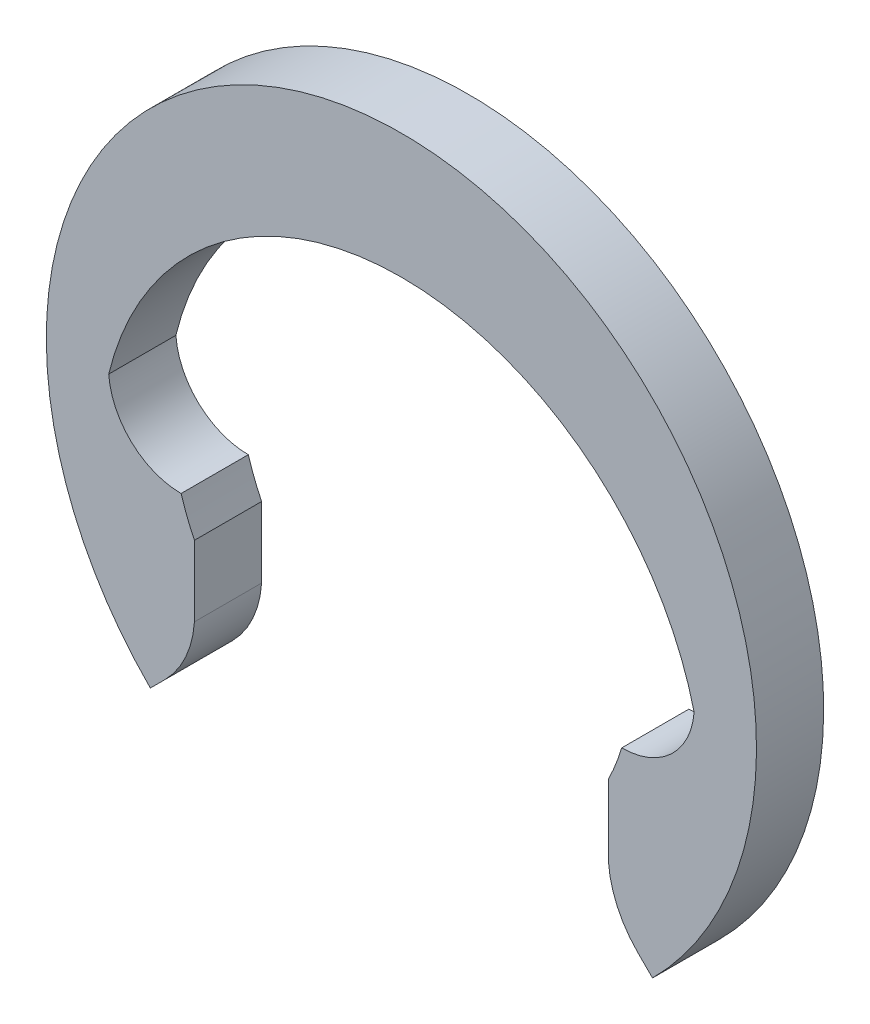
ISO-10303-21;
HEADER;
FILE_DESCRIPTION(('STEP AP214'),'2;1');
FILE_NAME('part.step','',(''),(''),'','','');
FILE_SCHEMA(('AUTOMOTIVE_DESIGN { 1 0 10303 214 1 1 1 1 }'));
ENDSEC;
DATA;
#1=APPLICATION_CONTEXT('core data for automotive mechanical design processes');
#2=APPLICATION_PROTOCOL_DEFINITION('international standard','automotive_design',2000,#1);
#3=PRODUCT_CONTEXT('',#1,'mechanical');
#4=PRODUCT('Part','Part','',(#3));
#5=PRODUCT_RELATED_PRODUCT_CATEGORY('part','',(#4));
#6=PRODUCT_DEFINITION_FORMATION('','',#4);
#7=PRODUCT_DEFINITION_CONTEXT('part definition',#1,'design');
#8=PRODUCT_DEFINITION('design','',#6,#7);
#9=PRODUCT_DEFINITION_SHAPE('','',#8);
#10=(LENGTH_UNIT() NAMED_UNIT(*) SI_UNIT(.MILLI.,.METRE.));
#11=(NAMED_UNIT(*) PLANE_ANGLE_UNIT() SI_UNIT($,.RADIAN.));
#12=(NAMED_UNIT(*) SI_UNIT($,.STERADIAN.) SOLID_ANGLE_UNIT());
#13=UNCERTAINTY_MEASURE_WITH_UNIT(LENGTH_MEASURE(1.E-05),#10,'distance_accuracy_value','');
#14=(GEOMETRIC_REPRESENTATION_CONTEXT(3) GLOBAL_UNCERTAINTY_ASSIGNED_CONTEXT((#13)) GLOBAL_UNIT_ASSIGNED_CONTEXT((#10,
#11,#12)) REPRESENTATION_CONTEXT('',''));
#15=CARTESIAN_POINT('',(0.,0.,0.));
#16=DIRECTION('',(0.,0.,1.));
#17=DIRECTION('',(1.,0.,0.));
#18=AXIS2_PLACEMENT_3D('',#15,#16,#17);
#19=CARTESIAN_POINT('',(-2.2956480566498,0.0564620388830174,0.7));
#20=DIRECTION('',(0.,0.,-1.));
#21=DIRECTION('',(-1.,0.,0.));
#22=AXIS2_PLACEMENT_3D('',#19,#20,#21);
#23=CYLINDRICAL_SURFACE('',#22,0.756462038883018);
#24=CARTESIAN_POINT('',(-2.2956480566498,0.0564620388830174,0.));
#25=DIRECTION('',(0.,0.,-1.));
#26=DIRECTION('',(1.,0.,0.));
#27=AXIS2_PLACEMENT_3D('',#24,#25,#26);
#28=CIRCLE('',#27,0.756462038883018);
#29=CARTESIAN_POINT('',(-2.2956480566498,-0.699999999999999,0.));
#30=VERTEX_POINT('',#29);
#31=CARTESIAN_POINT('',(-3.05,0.,0.));
#32=VERTEX_POINT('',#31);
#33=EDGE_CURVE('E152',#30,#32,#28,.T.);
#34=ORIENTED_EDGE('',*,*,#33,.T.);
#35=DIRECTION('',(0.,0.,-1.));
#36=VECTOR('',#35,1.);
#37=CARTESIAN_POINT('',(-3.05,0.,0.7));
#38=LINE('',#37,#36);
#39=CARTESIAN_POINT('',(-3.05,0.,0.7));
#40=VERTEX_POINT('',#39);
#41=EDGE_CURVE('E11',#40,#32,#38,.T.);
#42=ORIENTED_EDGE('',*,*,#41,.F.);
#43=CARTESIAN_POINT('',(-2.2956480566498,0.0564620388830174,0.7));
#44=DIRECTION('',(0.,0.,-1.));
#45=DIRECTION('',(1.,0.,0.));
#46=AXIS2_PLACEMENT_3D('',#43,#44,#45);
#47=CIRCLE('',#46,0.756462038883018);
#48=CARTESIAN_POINT('',(-2.2956480566498,-0.699999999999999,0.7));
#49=VERTEX_POINT('',#48);
#50=EDGE_CURVE('E175',#49,#40,#47,.T.);
#51=ORIENTED_EDGE('',*,*,#50,.F.);
#52=DIRECTION('',(0.,0.,-1.));
#53=VECTOR('',#52,1.);
#54=CARTESIAN_POINT('',(-2.2956480566498,-0.699999999999999,0.7));
#55=LINE('',#54,#53);
#56=EDGE_CURVE('E148',#49,#30,#55,.T.);
#57=ORIENTED_EDGE('',*,*,#56,.T.);
#58=EDGE_LOOP('',(#34,#42,#51,#57));
#59=FACE_BOUND('',#58,.T.);
#60=ADVANCED_FACE('F32',(#59),#23,.F.);
#61=CARTESIAN_POINT('',(0.,-0.738020833333334,0.7));
#62=DIRECTION('',(0.,0.,-1.));
#63=DIRECTION('',(-1.,0.,0.));
#64=AXIS2_PLACEMENT_3D('',#61,#62,#63);
#65=CYLINDRICAL_SURFACE('',#64,3.13802083333333);
#66=CARTESIAN_POINT('',(0.,-0.738020833333334,0.));
#67=DIRECTION('',(0.,0.,-1.));
#68=DIRECTION('',(1.,0.,0.));
#69=AXIS2_PLACEMENT_3D('',#66,#67,#68);
#70=CIRCLE('',#69,3.13802083333333);
#71=CARTESIAN_POINT('',(3.05,0.,0.));
#72=VERTEX_POINT('',#71);
#73=EDGE_CURVE('E155',#32,#72,#70,.T.);
#74=ORIENTED_EDGE('',*,*,#73,.T.);
#75=DIRECTION('',(0.,0.,-1.));
#76=VECTOR('',#75,1.);
#77=CARTESIAN_POINT('',(3.05,0.,0.7));
#78=LINE('',#77,#76);
#79=CARTESIAN_POINT('',(3.05,0.,0.7));
#80=VERTEX_POINT('',#79);
#81=EDGE_CURVE('E40',#80,#72,#78,.T.);
#82=ORIENTED_EDGE('',*,*,#81,.F.);
#83=CARTESIAN_POINT('',(0.,-0.738020833333334,0.7));
#84=DIRECTION('',(0.,0.,-1.));
#85=DIRECTION('',(1.,0.,0.));
#86=AXIS2_PLACEMENT_3D('',#83,#84,#85);
#87=CIRCLE('',#86,3.13802083333333);
#88=EDGE_CURVE('E102',#40,#80,#87,.T.);
#89=ORIENTED_EDGE('',*,*,#88,.F.);
#90=ORIENTED_EDGE('',*,*,#41,.T.);
#91=EDGE_LOOP('',(#74,#82,#89,#90));
#92=FACE_BOUND('',#91,.T.);
#93=ADVANCED_FACE('F252',(#92),#65,.F.);
#94=CARTESIAN_POINT('',(2.2956480566498,0.056462038883018,0.7));
#95=DIRECTION('',(0.,0.,-1.));
#96=DIRECTION('',(-1.,0.,0.));
#97=AXIS2_PLACEMENT_3D('',#94,#95,#96);
#98=CYLINDRICAL_SURFACE('',#97,0.756462038883018);
#99=CARTESIAN_POINT('',(2.2956480566498,0.056462038883018,0.));
#100=DIRECTION('',(0.,0.,-1.));
#101=DIRECTION('',(-1.,0.,0.));
#102=AXIS2_PLACEMENT_3D('',#99,#100,#101);
#103=CIRCLE('',#102,0.756462038883018);
#104=CARTESIAN_POINT('',(2.2956480566498,-0.7,0.));
#105=VERTEX_POINT('',#104);
#106=EDGE_CURVE('E157',#72,#105,#103,.T.);
#107=ORIENTED_EDGE('',*,*,#106,.T.);
#108=DIRECTION('',(0.,0.,-1.));
#109=VECTOR('',#108,1.);
#110=CARTESIAN_POINT('',(2.2956480566498,-0.7,0.7));
#111=LINE('',#110,#109);
#112=CARTESIAN_POINT('',(2.2956480566498,-0.7,0.7));
#113=VERTEX_POINT('',#112);
#114=EDGE_CURVE('E194',#113,#105,#111,.T.);
#115=ORIENTED_EDGE('',*,*,#114,.F.);
#116=CARTESIAN_POINT('',(2.2956480566498,0.056462038883018,0.7));
#117=DIRECTION('',(0.,0.,-1.));
#118=DIRECTION('',(-1.,0.,0.));
#119=AXIS2_PLACEMENT_3D('',#116,#117,#118);
#120=CIRCLE('',#119,0.756462038883018);
#121=EDGE_CURVE('E202',#80,#113,#120,.T.);
#122=ORIENTED_EDGE('',*,*,#121,.F.);
#123=ORIENTED_EDGE('',*,*,#81,.T.);
#124=EDGE_LOOP('',(#107,#115,#122,#123));
#125=FACE_BOUND('',#124,.T.);
#126=ADVANCED_FACE('F200',(#125),#98,.F.);
#127=CARTESIAN_POINT('',(0.,0.,0.7));
#128=DIRECTION('',(0.,0.,-1.));
#129=DIRECTION('',(-1.,0.,0.));
#130=AXIS2_PLACEMENT_3D('',#127,#128,#129);
#131=CYLINDRICAL_SURFACE('',#130,2.4);
#132=CARTESIAN_POINT('',(0.,0.,0.));
#133=DIRECTION('',(0.,0.,-1.));
#134=DIRECTION('',(-1.,0.,0.));
#135=AXIS2_PLACEMENT_3D('',#132,#133,#134);
#136=CIRCLE('',#135,2.4);
#137=CARTESIAN_POINT('',(2.15667568261897,-1.05297198443263,0.));
#138=VERTEX_POINT('',#137);
#139=EDGE_CURVE('E159',#105,#138,#136,.T.);
#140=ORIENTED_EDGE('',*,*,#139,.T.);
#141=DIRECTION('',(0.,0.,-1.));
#142=VECTOR('',#141,1.);
#143=CARTESIAN_POINT('',(2.15667568261897,-1.05297198443263,0.7));
#144=LINE('',#143,#142);
#145=CARTESIAN_POINT('',(2.15667568261897,-1.05297198443263,0.7));
#146=VERTEX_POINT('',#145);
#147=EDGE_CURVE('E191',#146,#138,#144,.T.);
#148=ORIENTED_EDGE('',*,*,#147,.F.);
#149=CARTESIAN_POINT('',(0.,0.,0.7));
#150=DIRECTION('',(0.,0.,-1.));
#151=DIRECTION('',(-1.,0.,0.));
#152=AXIS2_PLACEMENT_3D('',#149,#150,#151);
#153=CIRCLE('',#152,2.4);
#154=EDGE_CURVE('E219',#113,#146,#153,.T.);
#155=ORIENTED_EDGE('',*,*,#154,.F.);
#156=ORIENTED_EDGE('',*,*,#114,.T.);
#157=EDGE_LOOP('',(#140,#148,#155,#156));
#158=FACE_BOUND('',#157,.T.);
#159=ADVANCED_FACE('F210',(#158),#131,.F.);
#160=CARTESIAN_POINT('',(2.15667568261898,-1.78877444989019,0.7));
#161=DIRECTION('',(1.,0.,0.));
#162=DIRECTION('',(0.,1.,0.));
#163=AXIS2_PLACEMENT_3D('',#160,#161,#162);
#164=PLANE('',#163);
#165=DIRECTION('',(0.,-1.,0.));
#166=VECTOR('',#165,1.);
#167=CARTESIAN_POINT('',(2.15667568261898,-1.78877444989019,0.));
#168=LINE('',#167,#166);
#169=CARTESIAN_POINT('',(2.15667568261898,-1.78877444989019,0.));
#170=VERTEX_POINT('',#169);
#171=EDGE_CURVE('E162',#138,#170,#168,.T.);
#172=ORIENTED_EDGE('',*,*,#171,.T.);
#173=DIRECTION('',(0.,0.,-1.));
#174=VECTOR('',#173,1.);
#175=CARTESIAN_POINT('',(2.15667568261898,-1.78877444989019,0.7));
#176=LINE('',#175,#174);
#177=CARTESIAN_POINT('',(2.15667568261898,-1.78877444989019,0.7));
#178=VERTEX_POINT('',#177);
#179=EDGE_CURVE('E188',#178,#170,#176,.T.);
#180=ORIENTED_EDGE('',*,*,#179,.F.);
#181=DIRECTION('',(0.,-1.,0.));
#182=VECTOR('',#181,1.);
#183=CARTESIAN_POINT('',(2.15667568261897,-1.42087321716141,0.7));
#184=LINE('',#183,#182);
#185=EDGE_CURVE('E216',#146,#178,#184,.T.);
#186=ORIENTED_EDGE('',*,*,#185,.F.);
#187=ORIENTED_EDGE('',*,*,#147,.T.);
#188=EDGE_LOOP('',(#172,#180,#186,#187));
#189=FACE_BOUND('',#188,.T.);
#190=ADVANCED_FACE('F214',(#189),#164,.F.);
#191=CARTESIAN_POINT('',(3.20865351956933,-1.71752372269696,0.7));
#192=DIRECTION('',(0.,0.,-1.));
#193=DIRECTION('',(-1.,0.,0.));
#194=AXIS2_PLACEMENT_3D('',#191,#192,#193);
#195=CYLINDRICAL_SURFACE('',#194,1.05438799099777);
#196=CARTESIAN_POINT('',(3.20865351956933,-1.71752372269696,0.));
#197=DIRECTION('',(0.,0.,1.));
#198=DIRECTION('',(1.,0.,0.));
#199=AXIS2_PLACEMENT_3D('',#196,#197,#198);
#200=CIRCLE('',#199,1.05438799099777);
#201=CARTESIAN_POINT('',(2.46308862113314,-2.46308862113314,0.));
#202=VERTEX_POINT('',#201);
#203=EDGE_CURVE('E164',#170,#202,#200,.T.);
#204=ORIENTED_EDGE('',*,*,#203,.T.);
#205=DIRECTION('',(0.,0.,-1.));
#206=VECTOR('',#205,1.);
#207=CARTESIAN_POINT('',(2.46308862113314,-2.46308862113314,0.7));
#208=LINE('',#207,#206);
#209=CARTESIAN_POINT('',(2.46308862113314,-2.46308862113314,0.7));
#210=VERTEX_POINT('',#209);
#211=EDGE_CURVE('E185',#210,#202,#208,.T.);
#212=ORIENTED_EDGE('',*,*,#211,.F.);
#213=CARTESIAN_POINT('',(3.20865351956933,-1.71752372269696,0.7));
#214=DIRECTION('',(0.,0.,1.));
#215=DIRECTION('',(1.,0.,0.));
#216=AXIS2_PLACEMENT_3D('',#213,#214,#215);
#217=CIRCLE('',#216,1.05438799099777);
#218=EDGE_CURVE('E218',#178,#210,#217,.T.);
#219=ORIENTED_EDGE('',*,*,#218,.F.);
#220=ORIENTED_EDGE('',*,*,#179,.T.);
#221=EDGE_LOOP('',(#204,#212,#219,#220));
#222=FACE_BOUND('',#221,.T.);
#223=ADVANCED_FACE('F265',(#222),#195,.T.);
#224=CARTESIAN_POINT('',(2.46308862113315,-2.46308862113314,0.7));
#225=DIRECTION('',(0.707106781186549,0.707106781186547,0.));
#226=DIRECTION('',(-0.707106781186547,0.707106781186549,0.));
#227=AXIS2_PLACEMENT_3D('',#224,#225,#226);
#228=PLANE('',#227);
#229=DIRECTION('',(0.707106781186546,-0.707106781186548,0.));
#230=VECTOR('',#229,1.);
#231=CARTESIAN_POINT('',(2.46308862113315,-2.46308862113314,0.));
#232=LINE('',#231,#230);
#233=CARTESIAN_POINT('',(2.61629509039023,-2.61629509039022,0.));
#234=VERTEX_POINT('',#233);
#235=EDGE_CURVE('E166',#202,#234,#232,.T.);
#236=ORIENTED_EDGE('',*,*,#235,.T.);
#237=DIRECTION('',(0.,0.,-1.));
#238=VECTOR('',#237,1.);
#239=CARTESIAN_POINT('',(2.61629509039023,-2.61629509039022,0.7));
#240=LINE('',#239,#238);
#241=CARTESIAN_POINT('',(2.61629509039023,-2.61629509039022,0.7));
#242=VERTEX_POINT('',#241);
#243=EDGE_CURVE('E182',#242,#234,#240,.T.);
#244=ORIENTED_EDGE('',*,*,#243,.F.);
#245=DIRECTION('',(0.707106781186546,-0.707106781186548,0.));
#246=VECTOR('',#245,1.);
#247=CARTESIAN_POINT('',(2.46308862113315,-2.46308862113314,0.7));
#248=LINE('',#247,#246);
#249=EDGE_CURVE('E221',#210,#242,#248,.T.);
#250=ORIENTED_EDGE('',*,*,#249,.F.);
#251=ORIENTED_EDGE('',*,*,#211,.T.);
#252=EDGE_LOOP('',(#236,#244,#250,#251));
#253=FACE_BOUND('',#252,.T.);
#254=ADVANCED_FACE('F268',(#253),#228,.F.);
#255=CARTESIAN_POINT('',(0.,0.,0.7));
#256=DIRECTION('',(0.,0.,-1.));
#257=DIRECTION('',(-1.,0.,0.));
#258=AXIS2_PLACEMENT_3D('',#255,#256,#257);
#259=CYLINDRICAL_SURFACE('',#258,3.7);
#260=CARTESIAN_POINT('',(0.,0.,0.));
#261=DIRECTION('',(0.,0.,1.));
#262=DIRECTION('',(1.,0.,0.));
#263=AXIS2_PLACEMENT_3D('',#260,#261,#262);
#264=CIRCLE('',#263,3.7);
#265=CARTESIAN_POINT('',(-2.61629509039023,-2.61629509039022,0.));
#266=VERTEX_POINT('',#265);
#267=EDGE_CURVE('E168',#234,#266,#264,.T.);
#268=ORIENTED_EDGE('',*,*,#267,.T.);
#269=DIRECTION('',(0.,0.,-1.));
#270=VECTOR('',#269,1.);
#271=CARTESIAN_POINT('',(-2.61629509039023,-2.61629509039022,0.7));
#272=LINE('',#271,#270);
#273=CARTESIAN_POINT('',(-2.61629509039023,-2.61629509039022,0.7));
#274=VERTEX_POINT('',#273);
#275=EDGE_CURVE('E179',#274,#266,#272,.T.);
#276=ORIENTED_EDGE('',*,*,#275,.F.);
#277=CARTESIAN_POINT('',(0.,0.,0.7));
#278=DIRECTION('',(0.,0.,1.));
#279=DIRECTION('',(1.,0.,0.));
#280=AXIS2_PLACEMENT_3D('',#277,#278,#279);
#281=CIRCLE('',#280,3.7);
#282=EDGE_CURVE('E227',#242,#274,#281,.T.);
#283=ORIENTED_EDGE('',*,*,#282,.F.);
#284=ORIENTED_EDGE('',*,*,#243,.T.);
#285=EDGE_LOOP('',(#268,#276,#283,#284));
#286=FACE_BOUND('',#285,.T.);
#287=ADVANCED_FACE('F233',(#286),#259,.T.);
#288=CARTESIAN_POINT('',(-2.46308862113314,-2.46308862113314,0.7));
#289=DIRECTION('',(-0.707106781186549,0.707106781186547,0.));
#290=DIRECTION('',(-0.707106781186547,-0.707106781186549,0.));
#291=AXIS2_PLACEMENT_3D('',#288,#289,#290);
#292=PLANE('',#291);
#293=DIRECTION('',(0.707106781186546,0.707106781186548,0.));
#294=VECTOR('',#293,1.);
#295=CARTESIAN_POINT('',(-2.46308862113314,-2.46308862113314,0.));
#296=LINE('',#295,#294);
#297=CARTESIAN_POINT('',(-2.46308862113314,-2.46308862113314,0.));
#298=VERTEX_POINT('',#297);
#299=EDGE_CURVE('E170',#266,#298,#296,.T.);
#300=ORIENTED_EDGE('',*,*,#299,.T.);
#301=DIRECTION('',(0.,0.,-1.));
#302=VECTOR('',#301,1.);
#303=CARTESIAN_POINT('',(-2.46308862113314,-2.46308862113314,0.7));
#304=LINE('',#303,#302);
#305=CARTESIAN_POINT('',(-2.46308862113314,-2.46308862113314,0.7));
#306=VERTEX_POINT('',#305);
#307=EDGE_CURVE('E143',#306,#298,#304,.T.);
#308=ORIENTED_EDGE('',*,*,#307,.F.);
#309=DIRECTION('',(0.707106781186546,0.707106781186548,0.));
#310=VECTOR('',#309,1.);
#311=CARTESIAN_POINT('',(-2.46308862113314,-2.46308862113314,0.7));
#312=LINE('',#311,#310);
#313=EDGE_CURVE('E133',#274,#306,#312,.T.);
#314=ORIENTED_EDGE('',*,*,#313,.F.);
#315=ORIENTED_EDGE('',*,*,#275,.T.);
#316=EDGE_LOOP('',(#300,#308,#314,#315));
#317=FACE_BOUND('',#316,.T.);
#318=ADVANCED_FACE('F237',(#317),#292,.F.);
#319=CARTESIAN_POINT('',(-3.20865351956932,-1.71752372269696,0.7));
#320=DIRECTION('',(0.,0.,-1.));
#321=DIRECTION('',(-1.,0.,0.));
#322=AXIS2_PLACEMENT_3D('',#319,#320,#321);
#323=CYLINDRICAL_SURFACE('',#322,1.05438799099777);
#324=CARTESIAN_POINT('',(-3.20865351956932,-1.71752372269696,0.));
#325=DIRECTION('',(0.,0.,1.));
#326=DIRECTION('',(-1.,0.,0.));
#327=AXIS2_PLACEMENT_3D('',#324,#325,#326);
#328=CIRCLE('',#327,1.05438799099777);
#329=CARTESIAN_POINT('',(-2.15667568261897,-1.78877444989019,0.));
#330=VERTEX_POINT('',#329);
#331=EDGE_CURVE('E142',#298,#330,#328,.T.);
#332=ORIENTED_EDGE('',*,*,#331,.T.);
#333=DIRECTION('',(0.,0.,-1.));
#334=VECTOR('',#333,1.);
#335=CARTESIAN_POINT('',(-2.15667568261897,-1.78877444989019,0.7));
#336=LINE('',#335,#334);
#337=CARTESIAN_POINT('',(-2.15667568261897,-1.78877444989019,0.7));
#338=VERTEX_POINT('',#337);
#339=EDGE_CURVE('E139',#338,#330,#336,.T.);
#340=ORIENTED_EDGE('',*,*,#339,.F.);
#341=CARTESIAN_POINT('',(-3.20865351956932,-1.71752372269696,0.7));
#342=DIRECTION('',(0.,0.,1.));
#343=DIRECTION('',(-1.,0.,0.));
#344=AXIS2_PLACEMENT_3D('',#341,#342,#343);
#345=CIRCLE('',#344,1.05438799099777);
#346=EDGE_CURVE('E127',#306,#338,#345,.T.);
#347=ORIENTED_EDGE('',*,*,#346,.F.);
#348=ORIENTED_EDGE('',*,*,#307,.T.);
#349=EDGE_LOOP('',(#332,#340,#347,#348));
#350=FACE_BOUND('',#349,.T.);
#351=ADVANCED_FACE('F140',(#350),#323,.T.);
#352=CARTESIAN_POINT('',(-2.15667568261897,-1.42087321716141,0.7));
#353=DIRECTION('',(-1.,0.,0.));
#354=DIRECTION('',(0.,0.,1.));
#355=AXIS2_PLACEMENT_3D('',#352,#353,#354);
#356=PLANE('',#355);
#357=DIRECTION('',(0.,1.,0.));
#358=VECTOR('',#357,1.);
#359=CARTESIAN_POINT('',(-2.15667568261897,-1.42087321716141,0.));
#360=LINE('',#359,#358);
#361=CARTESIAN_POINT('',(-2.15667568261897,-1.05297198443263,0.));
#362=VERTEX_POINT('',#361);
#363=EDGE_CURVE('E88',#330,#362,#360,.T.);
#364=ORIENTED_EDGE('',*,*,#363,.T.);
#365=DIRECTION('',(0.,0.,-1.));
#366=VECTOR('',#365,1.);
#367=CARTESIAN_POINT('',(-2.15667568261897,-1.05297198443263,0.7));
#368=LINE('',#367,#366);
#369=CARTESIAN_POINT('',(-2.15667568261897,-1.05297198443263,0.7));
#370=VERTEX_POINT('',#369);
#371=EDGE_CURVE('E144',#370,#362,#368,.T.);
#372=ORIENTED_EDGE('',*,*,#371,.F.);
#373=DIRECTION('',(0.,1.,0.));
#374=VECTOR('',#373,1.);
#375=CARTESIAN_POINT('',(-2.15667568261897,-1.78877444989019,0.7));
#376=LINE('',#375,#374);
#377=EDGE_CURVE('E131',#338,#370,#376,.T.);
#378=ORIENTED_EDGE('',*,*,#377,.F.);
#379=ORIENTED_EDGE('',*,*,#339,.T.);
#380=EDGE_LOOP('',(#364,#372,#378,#379));
#381=FACE_BOUND('',#380,.T.);
#382=ADVANCED_FACE('F146',(#381),#356,.F.);
#383=CARTESIAN_POINT('',(0.,0.,0.7));
#384=DIRECTION('',(0.,0.,-1.));
#385=DIRECTION('',(-1.,0.,0.));
#386=AXIS2_PLACEMENT_3D('',#383,#384,#385);
#387=CYLINDRICAL_SURFACE('',#386,2.4);
#388=CARTESIAN_POINT('',(0.,0.,0.));
#389=DIRECTION('',(0.,0.,-1.));
#390=DIRECTION('',(1.,0.,0.));
#391=AXIS2_PLACEMENT_3D('',#388,#389,#390);
#392=CIRCLE('',#391,2.4);
#393=EDGE_CURVE('E94',#362,#30,#392,.T.);
#394=ORIENTED_EDGE('',*,*,#393,.T.);
#395=ORIENTED_EDGE('',*,*,#56,.F.);
#396=CARTESIAN_POINT('',(0.,0.,0.7));
#397=DIRECTION('',(0.,0.,-1.));
#398=DIRECTION('',(1.,0.,0.));
#399=AXIS2_PLACEMENT_3D('',#396,#397,#398);
#400=CIRCLE('',#399,2.4);
#401=EDGE_CURVE('E48',#370,#49,#400,.T.);
#402=ORIENTED_EDGE('',*,*,#401,.F.);
#403=ORIENTED_EDGE('',*,*,#371,.T.);
#404=EDGE_LOOP('',(#394,#395,#402,#403));
#405=FACE_BOUND('',#404,.T.);
#406=ADVANCED_FACE('F241',(#405),#387,.F.);
#407=CARTESIAN_POINT('',(-2.2956480566498,0.0564620388830174,0.7));
#408=DIRECTION('',(0.,0.,1.));
#409=DIRECTION('',(1.,0.,0.));
#410=AXIS2_PLACEMENT_3D('',#407,#408,#409);
#411=PLANE('',#410);
#412=ORIENTED_EDGE('',*,*,#50,.T.);
#413=ORIENTED_EDGE('',*,*,#88,.T.);
#414=ORIENTED_EDGE('',*,*,#121,.T.);
#415=ORIENTED_EDGE('',*,*,#154,.T.);
#416=ORIENTED_EDGE('',*,*,#185,.T.);
#417=ORIENTED_EDGE('',*,*,#218,.T.);
#418=ORIENTED_EDGE('',*,*,#249,.T.);
#419=ORIENTED_EDGE('',*,*,#282,.T.);
#420=ORIENTED_EDGE('',*,*,#313,.T.);
#421=ORIENTED_EDGE('',*,*,#346,.T.);
#422=ORIENTED_EDGE('',*,*,#377,.T.);
#423=ORIENTED_EDGE('',*,*,#401,.T.);
#424=EDGE_LOOP('',(#412,#413,#414,#415,#416,#417,#418,#419,#420,#421,#422,#423));
#425=FACE_BOUND('',#424,.T.);
#426=ADVANCED_FACE('F129',(#425),#411,.T.);
#427=CARTESIAN_POINT('',(-2.2956480566498,0.0564620388830174,0.));
#428=DIRECTION('',(0.,0.,1.));
#429=DIRECTION('',(1.,0.,0.));
#430=AXIS2_PLACEMENT_3D('',#427,#428,#429);
#431=PLANE('',#430);
#432=ORIENTED_EDGE('',*,*,#33,.F.);
#433=ORIENTED_EDGE('',*,*,#393,.F.);
#434=ORIENTED_EDGE('',*,*,#363,.F.);
#435=ORIENTED_EDGE('',*,*,#331,.F.);
#436=ORIENTED_EDGE('',*,*,#299,.F.);
#437=ORIENTED_EDGE('',*,*,#267,.F.);
#438=ORIENTED_EDGE('',*,*,#235,.F.);
#439=ORIENTED_EDGE('',*,*,#203,.F.);
#440=ORIENTED_EDGE('',*,*,#171,.F.);
#441=ORIENTED_EDGE('',*,*,#139,.F.);
#442=ORIENTED_EDGE('',*,*,#106,.F.);
#443=ORIENTED_EDGE('',*,*,#73,.F.);
#444=EDGE_LOOP('',(#432,#433,#434,#435,#436,#437,#438,#439,#440,#441,#442,#443));
#445=FACE_BOUND('',#444,.T.);
#446=ADVANCED_FACE('F206',(#445),#431,.F.);
#447=CLOSED_SHELL('',(#60,#93,#126,#159,#190,#223,#254,#287,#318,#351,#382,#406,#426,#446));
#448=MANIFOLD_SOLID_BREP('B2',#447);
#449=ADVANCED_BREP_SHAPE_REPRESENTATION('',(#18,#448),#14);
#450=SHAPE_DEFINITION_REPRESENTATION(#9,#449);
ENDSEC;
END-ISO-10303-21;
